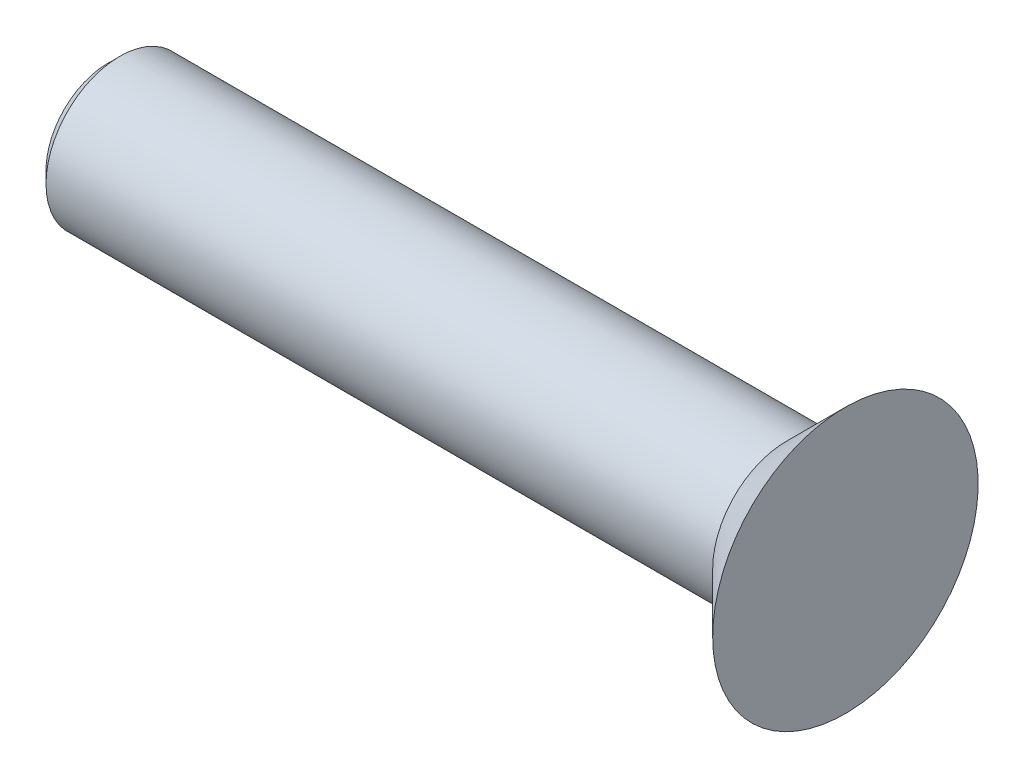
ISO-10303-21;
HEADER;
FILE_DESCRIPTION(('STEP AP214'),'2;1');
FILE_NAME('part.step','',(''),(''),'','','');
FILE_SCHEMA(('AUTOMOTIVE_DESIGN { 1 0 10303 214 1 1 1 1 }'));
ENDSEC;
DATA;
#1=APPLICATION_CONTEXT('core data for automotive mechanical design processes');
#2=APPLICATION_PROTOCOL_DEFINITION('international standard','automotive_design',2000,#1);
#3=PRODUCT_CONTEXT('',#1,'mechanical');
#4=PRODUCT('Part','Part','',(#3));
#5=PRODUCT_RELATED_PRODUCT_CATEGORY('part','',(#4));
#6=PRODUCT_DEFINITION_FORMATION('','',#4);
#7=PRODUCT_DEFINITION_CONTEXT('part definition',#1,'design');
#8=PRODUCT_DEFINITION('design','',#6,#7);
#9=PRODUCT_DEFINITION_SHAPE('','',#8);
#10=(LENGTH_UNIT() NAMED_UNIT(*) SI_UNIT(.MILLI.,.METRE.));
#11=(NAMED_UNIT(*) PLANE_ANGLE_UNIT() SI_UNIT($,.RADIAN.));
#12=(NAMED_UNIT(*) SI_UNIT($,.STERADIAN.) SOLID_ANGLE_UNIT());
#13=UNCERTAINTY_MEASURE_WITH_UNIT(LENGTH_MEASURE(1.E-05),#10,'distance_accuracy_value','');
#14=(GEOMETRIC_REPRESENTATION_CONTEXT(3) GLOBAL_UNCERTAINTY_ASSIGNED_CONTEXT((#13)) GLOBAL_UNIT_ASSIGNED_CONTEXT((#10,
#11,#12)) REPRESENTATION_CONTEXT('',''));
#15=CARTESIAN_POINT('',(0.,0.,0.));
#16=DIRECTION('',(0.,0.,1.));
#17=DIRECTION('',(1.,0.,0.));
#18=AXIS2_PLACEMENT_3D('',#15,#16,#17);
#19=CARTESIAN_POINT('',(0.,4.49999999999998,0.));
#20=DIRECTION('',(-1.,0.,0.));
#21=DIRECTION('',(0.,0.,1.));
#22=AXIS2_PLACEMENT_3D('',#19,#20,#21);
#23=PLANE('',#22);
#24=CARTESIAN_POINT('',(0.,0.,0.));
#25=DIRECTION('',(-1.,0.,0.));
#26=DIRECTION('',(0.,0.,1.));
#27=AXIS2_PLACEMENT_3D('',#24,#25,#26);
#28=CIRCLE('',#27,4.49999999999998);
#29=CARTESIAN_POINT('',(0.,0.,4.49999999999998));
#30=VERTEX_POINT('',#29);
#31=EDGE_CURVE('E42',#30,#30,#28,.T.);
#32=ORIENTED_EDGE('',*,*,#31,.F.);
#33=EDGE_LOOP('',(#32));
#34=FACE_BOUND('',#33,.T.);
#35=ADVANCED_FACE('F32',(#34),#23,.F.);
#36=CARTESIAN_POINT('',(0.,0.,0.));
#37=DIRECTION('',(1.,0.,0.));
#38=DIRECTION('',(0.,0.,-1.));
#39=AXIS2_PLACEMENT_3D('',#36,#37,#38);
#40=CONICAL_SURFACE('',#39,4.49999999999998,0.785398163397443);
#41=CARTESIAN_POINT('',(-2.,0.,0.));
#42=DIRECTION('',(-1.,0.,0.));
#43=DIRECTION('',(0.,0.,1.));
#44=AXIS2_PLACEMENT_3D('',#41,#42,#43);
#45=CIRCLE('',#44,2.5);
#46=CARTESIAN_POINT('',(-2.,0.,2.5));
#47=VERTEX_POINT('',#46);
#48=EDGE_CURVE('E46',#47,#47,#45,.T.);
#49=ORIENTED_EDGE('',*,*,#48,.F.);
#50=EDGE_LOOP('',(#49));
#51=FACE_BOUND('',#50,.T.);
#52=ORIENTED_EDGE('',*,*,#31,.T.);
#53=EDGE_LOOP('',(#52));
#54=FACE_BOUND('',#53,.T.);
#55=ADVANCED_FACE('F54',(#51,#54),#40,.T.);
#56=CARTESIAN_POINT('',(0.,0.,0.));
#57=DIRECTION('',(-1.,0.,0.));
#58=DIRECTION('',(0.,0.,1.));
#59=AXIS2_PLACEMENT_3D('',#56,#57,#58);
#60=CYLINDRICAL_SURFACE('',#59,2.5);
#61=CARTESIAN_POINT('',(-24.6,0.,0.));
#62=DIRECTION('',(1.,0.,0.));
#63=DIRECTION('',(0.,0.,-1.));
#64=AXIS2_PLACEMENT_3D('',#61,#62,#63);
#65=CIRCLE('',#64,2.5);
#66=CARTESIAN_POINT('',(-24.6,0.,-2.5));
#67=VERTEX_POINT('',#66);
#68=EDGE_CURVE('E10',#67,#67,#65,.T.);
#69=ORIENTED_EDGE('',*,*,#68,.T.);
#70=EDGE_LOOP('',(#69));
#71=FACE_BOUND('',#70,.T.);
#72=ORIENTED_EDGE('',*,*,#48,.T.);
#73=EDGE_LOOP('',(#72));
#74=FACE_BOUND('',#73,.T.);
#75=ADVANCED_FACE('F52',(#71,#74),#60,.T.);
#76=CARTESIAN_POINT('',(-25.,0.,0.));
#77=DIRECTION('',(1.,0.,0.));
#78=DIRECTION('',(0.,0.,-1.));
#79=AXIS2_PLACEMENT_3D('',#76,#77,#78);
#80=PLANE('',#79);
#81=CARTESIAN_POINT('',(-25.,0.,0.));
#82=DIRECTION('',(1.,0.,0.));
#83=DIRECTION('',(0.,0.,-1.));
#84=AXIS2_PLACEMENT_3D('',#81,#82,#83);
#85=CIRCLE('',#84,2.1);
#86=CARTESIAN_POINT('',(-25.,0.,-2.1));
#87=VERTEX_POINT('',#86);
#88=EDGE_CURVE('E38',#87,#87,#85,.F.);
#89=ORIENTED_EDGE('',*,*,#88,.T.);
#90=EDGE_LOOP('',(#89));
#91=FACE_BOUND('',#90,.T.);
#92=ADVANCED_FACE('F73',(#91),#80,.F.);
#93=CARTESIAN_POINT('',(-25.,0.,0.));
#94=DIRECTION('',(1.,0.,0.));
#95=DIRECTION('',(0.,0.,-1.));
#96=AXIS2_PLACEMENT_3D('',#93,#94,#95);
#97=CONICAL_SURFACE('',#96,2.1,0.78539816339745);
#98=ORIENTED_EDGE('',*,*,#68,.F.);
#99=EDGE_LOOP('',(#98));
#100=FACE_BOUND('',#99,.T.);
#101=ORIENTED_EDGE('',*,*,#88,.F.);
#102=EDGE_LOOP('',(#101));
#103=FACE_BOUND('',#102,.T.);
#104=ADVANCED_FACE('F79',(#100,#103),#97,.T.);
#105=CLOSED_SHELL('',(#35,#55,#75,#92,#104));
#106=MANIFOLD_SOLID_BREP('B2',#105);
#107=ADVANCED_BREP_SHAPE_REPRESENTATION('',(#18,#106),#14);
#108=SHAPE_DEFINITION_REPRESENTATION(#9,#107);
ENDSEC;
END-ISO-10303-21;
